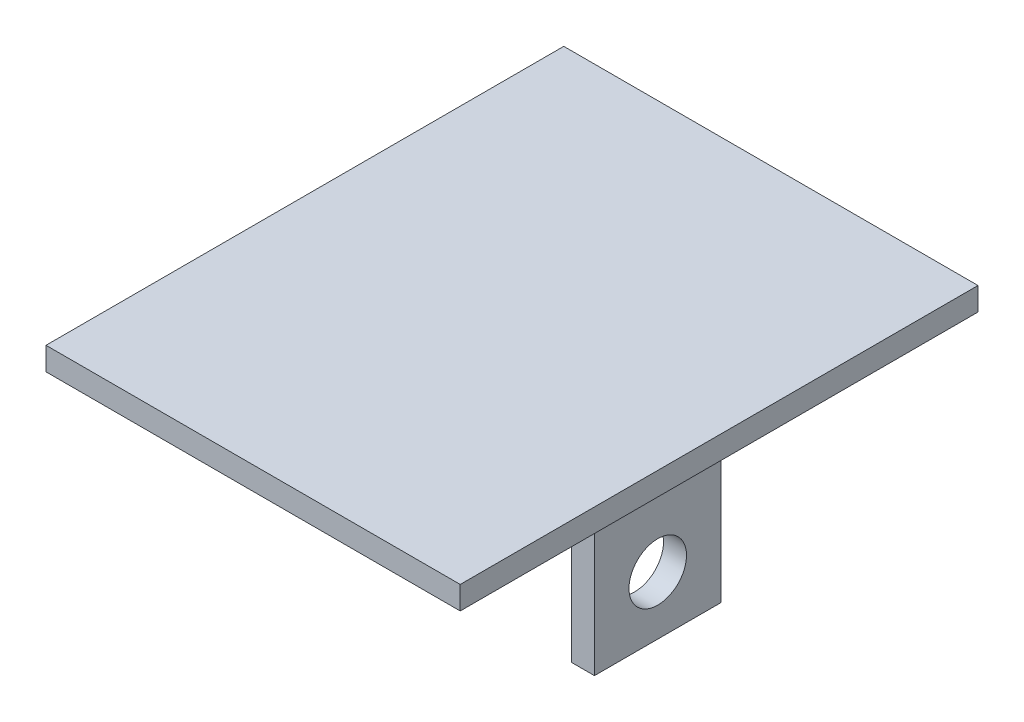
ISO-10303-21;
HEADER;
FILE_DESCRIPTION(('STEP AP214'),'2;1');
FILE_NAME('part.step','',(''),(''),'','','');
FILE_SCHEMA(('AUTOMOTIVE_DESIGN { 1 0 10303 214 1 1 1 1 }'));
ENDSEC;
DATA;
#1=APPLICATION_CONTEXT('core data for automotive mechanical design processes');
#2=APPLICATION_PROTOCOL_DEFINITION('international standard','automotive_design',2000,#1);
#3=PRODUCT_CONTEXT('',#1,'mechanical');
#4=PRODUCT('Part','Part','',(#3));
#5=PRODUCT_RELATED_PRODUCT_CATEGORY('part','',(#4));
#6=PRODUCT_DEFINITION_FORMATION('','',#4);
#7=PRODUCT_DEFINITION_CONTEXT('part definition',#1,'design');
#8=PRODUCT_DEFINITION('design','',#6,#7);
#9=PRODUCT_DEFINITION_SHAPE('','',#8);
#10=(LENGTH_UNIT() NAMED_UNIT(*) SI_UNIT(.MILLI.,.METRE.));
#11=(NAMED_UNIT(*) PLANE_ANGLE_UNIT() SI_UNIT($,.RADIAN.));
#12=(NAMED_UNIT(*) SI_UNIT($,.STERADIAN.) SOLID_ANGLE_UNIT());
#13=UNCERTAINTY_MEASURE_WITH_UNIT(LENGTH_MEASURE(1.E-05),#10,'distance_accuracy_value','');
#14=(GEOMETRIC_REPRESENTATION_CONTEXT(3) GLOBAL_UNCERTAINTY_ASSIGNED_CONTEXT((#13)) GLOBAL_UNIT_ASSIGNED_CONTEXT((#10,
#11,#12)) REPRESENTATION_CONTEXT('',''));
#15=CARTESIAN_POINT('',(0.,0.,0.));
#16=DIRECTION('',(0.,0.,1.));
#17=DIRECTION('',(1.,0.,0.));
#18=AXIS2_PLACEMENT_3D('',#15,#16,#17);
#19=CARTESIAN_POINT('',(0.,0.,0.));
#20=DIRECTION('',(0.,1.,0.));
#21=DIRECTION('',(0.,0.,1.));
#22=AXIS2_PLACEMENT_3D('',#19,#20,#21);
#23=PLANE('',#22);
#24=DIRECTION('',(1.,0.,0.));
#25=VECTOR('',#24,1.);
#26=CARTESIAN_POINT('',(0.,0.,-5.46614350086655));
#27=LINE('',#26,#25);
#28=CARTESIAN_POINT('',(10.7,0.,-5.46614350086655));
#29=VERTEX_POINT('',#28);
#30=CARTESIAN_POINT('',(12.7,0.,-5.46614350086655));
#31=VERTEX_POINT('',#30);
#32=EDGE_CURVE('E156',#29,#31,#27,.T.);
#33=ORIENTED_EDGE('',*,*,#32,.F.);
#34=DIRECTION('',(0.,0.,1.));
#35=VECTOR('',#34,1.);
#36=CARTESIAN_POINT('',(10.7,0.,0.));
#37=LINE('',#36,#35);
#38=CARTESIAN_POINT('',(10.7,0.,5.53385649913345));
#39=VERTEX_POINT('',#38);
#40=EDGE_CURVE('E129',#29,#39,#37,.T.);
#41=ORIENTED_EDGE('',*,*,#40,.T.);
#42=DIRECTION('',(1.,0.,0.));
#43=VECTOR('',#42,1.);
#44=CARTESIAN_POINT('',(0.,0.,5.53385649913345));
#45=LINE('',#44,#43);
#46=CARTESIAN_POINT('',(12.7,0.,5.53385649913345));
#47=VERTEX_POINT('',#46);
#48=EDGE_CURVE('E147',#39,#47,#45,.T.);
#49=ORIENTED_EDGE('',*,*,#48,.T.);
#50=DIRECTION('',(0.,0.,1.));
#51=VECTOR('',#50,1.);
#52=CARTESIAN_POINT('',(12.7,0.,0.));
#53=LINE('',#52,#51);
#54=EDGE_CURVE('E150',#31,#47,#53,.T.);
#55=ORIENTED_EDGE('',*,*,#54,.F.);
#56=EDGE_LOOP('',(#33,#41,#49,#55));
#57=FACE_BOUND('',#56,.T.);
#58=DIRECTION('',(0.,0.,-1.));
#59=VECTOR('',#58,1.);
#60=CARTESIAN_POINT('',(18.,0.,-22.5));
#61=LINE('',#60,#59);
#62=CARTESIAN_POINT('',(18.,0.,22.5));
#63=VERTEX_POINT('',#62);
#64=CARTESIAN_POINT('',(18.,0.,-22.5));
#65=VERTEX_POINT('',#64);
#66=EDGE_CURVE('E179',#63,#65,#61,.T.);
#67=ORIENTED_EDGE('',*,*,#66,.F.);
#68=DIRECTION('',(1.,0.,0.));
#69=VECTOR('',#68,1.);
#70=CARTESIAN_POINT('',(-18.,0.,22.5));
#71=LINE('',#70,#69);
#72=CARTESIAN_POINT('',(-18.,0.,22.5));
#73=VERTEX_POINT('',#72);
#74=EDGE_CURVE('E184',#73,#63,#71,.T.);
#75=ORIENTED_EDGE('',*,*,#74,.F.);
#76=DIRECTION('',(0.,0.,1.));
#77=VECTOR('',#76,1.);
#78=CARTESIAN_POINT('',(-18.,0.,-22.5));
#79=LINE('',#78,#77);
#80=CARTESIAN_POINT('',(-18.,0.,-22.5));
#81=VERTEX_POINT('',#80);
#82=EDGE_CURVE('E195',#81,#73,#79,.T.);
#83=ORIENTED_EDGE('',*,*,#82,.F.);
#84=DIRECTION('',(-1.,0.,0.));
#85=VECTOR('',#84,1.);
#86=CARTESIAN_POINT('',(-18.,0.,-22.5));
#87=LINE('',#86,#85);
#88=EDGE_CURVE('E193',#65,#81,#87,.T.);
#89=ORIENTED_EDGE('',*,*,#88,.F.);
#90=EDGE_LOOP('',(#67,#75,#83,#89));
#91=FACE_BOUND('',#90,.T.);
#92=DIRECTION('',(0.,0.,1.));
#93=VECTOR('',#92,1.);
#94=CARTESIAN_POINT('',(-15.,0.,0.));
#95=LINE('',#94,#93);
#96=CARTESIAN_POINT('',(-15.,0.,-5.5));
#97=VERTEX_POINT('',#96);
#98=CARTESIAN_POINT('',(-15.,0.,5.53385649913345));
#99=VERTEX_POINT('',#98);
#100=EDGE_CURVE('E11',#97,#99,#95,.T.);
#101=ORIENTED_EDGE('',*,*,#100,.F.);
#102=DIRECTION('',(-1.,0.,0.));
#103=VECTOR('',#102,1.);
#104=CARTESIAN_POINT('',(0.,0.,-5.5));
#105=LINE('',#104,#103);
#106=CARTESIAN_POINT('',(-17.,0.,-5.5));
#107=VERTEX_POINT('',#106);
#108=EDGE_CURVE('E209',#97,#107,#105,.T.);
#109=ORIENTED_EDGE('',*,*,#108,.T.);
#110=DIRECTION('',(0.,0.,1.));
#111=VECTOR('',#110,1.);
#112=CARTESIAN_POINT('',(-17.,0.,0.));
#113=LINE('',#112,#111);
#114=CARTESIAN_POINT('',(-17.,0.,5.53385649913345));
#115=VERTEX_POINT('',#114);
#116=EDGE_CURVE('E212',#107,#115,#113,.T.);
#117=ORIENTED_EDGE('',*,*,#116,.T.);
#118=DIRECTION('',(-1.,0.,0.));
#119=VECTOR('',#118,1.);
#120=CARTESIAN_POINT('',(0.,0.,5.53385649913345));
#121=LINE('',#120,#119);
#122=EDGE_CURVE('E41',#99,#115,#121,.T.);
#123=ORIENTED_EDGE('',*,*,#122,.F.);
#124=EDGE_LOOP('',(#101,#109,#117,#123));
#125=FACE_BOUND('',#124,.T.);
#126=ADVANCED_FACE('F33',(#57,#91,#125),#23,.F.);
#127=CARTESIAN_POINT('',(18.,2.,-22.5));
#128=DIRECTION('',(-1.,0.,0.));
#129=DIRECTION('',(0.,0.,1.));
#130=AXIS2_PLACEMENT_3D('',#127,#128,#129);
#131=PLANE('',#130);
#132=ORIENTED_EDGE('',*,*,#66,.T.);
#133=DIRECTION('',(0.,-1.,0.));
#134=VECTOR('',#133,1.);
#135=CARTESIAN_POINT('',(18.,2.,-22.5));
#136=LINE('',#135,#134);
#137=CARTESIAN_POINT('',(18.,2.,-22.5));
#138=VERTEX_POINT('',#137);
#139=EDGE_CURVE('E206',#138,#65,#136,.T.);
#140=ORIENTED_EDGE('',*,*,#139,.F.);
#141=DIRECTION('',(0.,0.,-1.));
#142=VECTOR('',#141,1.);
#143=CARTESIAN_POINT('',(18.,2.,-22.5));
#144=LINE('',#143,#142);
#145=CARTESIAN_POINT('',(18.,2.,22.5));
#146=VERTEX_POINT('',#145);
#147=EDGE_CURVE('E180',#146,#138,#144,.T.);
#148=ORIENTED_EDGE('',*,*,#147,.F.);
#149=DIRECTION('',(0.,-1.,0.));
#150=VECTOR('',#149,1.);
#151=CARTESIAN_POINT('',(18.,2.,22.5));
#152=LINE('',#151,#150);
#153=EDGE_CURVE('E190',#146,#63,#152,.T.);
#154=ORIENTED_EDGE('',*,*,#153,.T.);
#155=EDGE_LOOP('',(#132,#140,#148,#154));
#156=FACE_BOUND('',#155,.T.);
#157=ADVANCED_FACE('F35',(#156),#131,.F.);
#158=CARTESIAN_POINT('',(-18.,2.,-22.5));
#159=DIRECTION('',(0.,0.,1.));
#160=DIRECTION('',(1.,0.,0.));
#161=AXIS2_PLACEMENT_3D('',#158,#159,#160);
#162=PLANE('',#161);
#163=ORIENTED_EDGE('',*,*,#88,.T.);
#164=DIRECTION('',(0.,-1.,0.));
#165=VECTOR('',#164,1.);
#166=CARTESIAN_POINT('',(-18.,2.,-22.5));
#167=LINE('',#166,#165);
#168=CARTESIAN_POINT('',(-18.,2.,-22.5));
#169=VERTEX_POINT('',#168);
#170=EDGE_CURVE('E203',#169,#81,#167,.T.);
#171=ORIENTED_EDGE('',*,*,#170,.F.);
#172=DIRECTION('',(-1.,0.,0.));
#173=VECTOR('',#172,1.);
#174=CARTESIAN_POINT('',(-18.,2.,-22.5));
#175=LINE('',#174,#173);
#176=EDGE_CURVE('E183',#138,#169,#175,.T.);
#177=ORIENTED_EDGE('',*,*,#176,.F.);
#178=ORIENTED_EDGE('',*,*,#139,.T.);
#179=EDGE_LOOP('',(#163,#171,#177,#178));
#180=FACE_BOUND('',#179,.T.);
#181=ADVANCED_FACE('F247',(#180),#162,.F.);
#182=CARTESIAN_POINT('',(-18.,2.,-22.5));
#183=DIRECTION('',(1.,0.,0.));
#184=DIRECTION('',(0.,0.,-1.));
#185=AXIS2_PLACEMENT_3D('',#182,#183,#184);
#186=PLANE('',#185);
#187=ORIENTED_EDGE('',*,*,#82,.T.);
#188=DIRECTION('',(0.,-1.,0.));
#189=VECTOR('',#188,1.);
#190=CARTESIAN_POINT('',(-18.,2.,22.5));
#191=LINE('',#190,#189);
#192=CARTESIAN_POINT('',(-18.,2.,22.5));
#193=VERTEX_POINT('',#192);
#194=EDGE_CURVE('E200',#193,#73,#191,.T.);
#195=ORIENTED_EDGE('',*,*,#194,.F.);
#196=DIRECTION('',(0.,0.,1.));
#197=VECTOR('',#196,1.);
#198=CARTESIAN_POINT('',(-18.,2.,-22.5));
#199=LINE('',#198,#197);
#200=EDGE_CURVE('E186',#169,#193,#199,.T.);
#201=ORIENTED_EDGE('',*,*,#200,.F.);
#202=ORIENTED_EDGE('',*,*,#170,.T.);
#203=EDGE_LOOP('',(#187,#195,#201,#202));
#204=FACE_BOUND('',#203,.T.);
#205=ADVANCED_FACE('F257',(#204),#186,.F.);
#206=CARTESIAN_POINT('',(-18.,2.,22.5));
#207=DIRECTION('',(0.,0.,-1.));
#208=DIRECTION('',(-1.,0.,0.));
#209=AXIS2_PLACEMENT_3D('',#206,#207,#208);
#210=PLANE('',#209);
#211=ORIENTED_EDGE('',*,*,#74,.T.);
#212=ORIENTED_EDGE('',*,*,#153,.F.);
#213=DIRECTION('',(1.,0.,0.));
#214=VECTOR('',#213,1.);
#215=CARTESIAN_POINT('',(-18.,2.,22.5));
#216=LINE('',#215,#214);
#217=EDGE_CURVE('E188',#193,#146,#216,.T.);
#218=ORIENTED_EDGE('',*,*,#217,.F.);
#219=ORIENTED_EDGE('',*,*,#194,.T.);
#220=EDGE_LOOP('',(#211,#212,#218,#219));
#221=FACE_BOUND('',#220,.T.);
#222=ADVANCED_FACE('F254',(#221),#210,.F.);
#223=CARTESIAN_POINT('',(0.,2.,0.));
#224=DIRECTION('',(0.,1.,0.));
#225=DIRECTION('',(0.,0.,1.));
#226=AXIS2_PLACEMENT_3D('',#223,#224,#225);
#227=PLANE('',#226);
#228=ORIENTED_EDGE('',*,*,#147,.T.);
#229=ORIENTED_EDGE('',*,*,#176,.T.);
#230=ORIENTED_EDGE('',*,*,#200,.T.);
#231=ORIENTED_EDGE('',*,*,#217,.T.);
#232=EDGE_LOOP('',(#228,#229,#230,#231));
#233=FACE_BOUND('',#232,.T.);
#234=ADVANCED_FACE('F252',(#233),#227,.T.);
#235=CARTESIAN_POINT('',(-15.,-16.,-5.5));
#236=DIRECTION('',(-1.,0.,0.));
#237=DIRECTION('',(0.,0.,1.));
#238=AXIS2_PLACEMENT_3D('',#235,#236,#237);
#239=PLANE('',#238);
#240=CARTESIAN_POINT('',(-15.,-10.94,0.0338564991334495));
#241=DIRECTION('',(-1.,0.,0.));
#242=DIRECTION('',(0.,0.,1.));
#243=AXIS2_PLACEMENT_3D('',#240,#241,#242);
#244=CIRCLE('',#243,2.5);
#245=CARTESIAN_POINT('',(-15.,-10.94,2.53385649913345));
#246=VERTEX_POINT('',#245);
#247=EDGE_CURVE('E133',#246,#246,#244,.T.);
#248=ORIENTED_EDGE('',*,*,#247,.T.);
#249=EDGE_LOOP('',(#248));
#250=FACE_BOUND('',#249,.T.);
#251=DIRECTION('',(0.,1.,0.));
#252=VECTOR('',#251,1.);
#253=CARTESIAN_POINT('',(-15.,-16.,-5.5));
#254=LINE('',#253,#252);
#255=CARTESIAN_POINT('',(-15.,-16.,-5.5));
#256=VERTEX_POINT('',#255);
#257=EDGE_CURVE('E169',#256,#97,#254,.T.);
#258=ORIENTED_EDGE('',*,*,#257,.T.);
#259=ORIENTED_EDGE('',*,*,#100,.T.);
#260=DIRECTION('',(0.,1.,0.));
#261=VECTOR('',#260,1.);
#262=CARTESIAN_POINT('',(-15.,-16.,5.53385649913345));
#263=LINE('',#262,#261);
#264=CARTESIAN_POINT('',(-15.,-16.,5.53385649913345));
#265=VERTEX_POINT('',#264);
#266=EDGE_CURVE('E176',#265,#99,#263,.T.);
#267=ORIENTED_EDGE('',*,*,#266,.F.);
#268=DIRECTION('',(0.,0.,1.));
#269=VECTOR('',#268,1.);
#270=CARTESIAN_POINT('',(-15.,-16.,-5.5));
#271=LINE('',#270,#269);
#272=EDGE_CURVE('E159',#256,#265,#271,.T.);
#273=ORIENTED_EDGE('',*,*,#272,.F.);
#274=EDGE_LOOP('',(#258,#259,#267,#273));
#275=FACE_BOUND('',#274,.T.);
#276=ADVANCED_FACE('F227',(#250,#275),#239,.F.);
#277=CARTESIAN_POINT('',(-15.,-16.,5.53385649913345));
#278=DIRECTION('',(0.,0.,-1.));
#279=DIRECTION('',(-1.,0.,0.));
#280=AXIS2_PLACEMENT_3D('',#277,#278,#279);
#281=PLANE('',#280);
#282=ORIENTED_EDGE('',*,*,#266,.T.);
#283=ORIENTED_EDGE('',*,*,#122,.T.);
#284=DIRECTION('',(0.,1.,0.));
#285=VECTOR('',#284,1.);
#286=CARTESIAN_POINT('',(-17.,-16.,5.53385649913345));
#287=LINE('',#286,#285);
#288=CARTESIAN_POINT('',(-17.,-16.,5.53385649913345));
#289=VERTEX_POINT('',#288);
#290=EDGE_CURVE('E173',#289,#115,#287,.T.);
#291=ORIENTED_EDGE('',*,*,#290,.F.);
#292=DIRECTION('',(-1.,0.,0.));
#293=VECTOR('',#292,1.);
#294=CARTESIAN_POINT('',(-15.,-16.,5.53385649913345));
#295=LINE('',#294,#293);
#296=EDGE_CURVE('E162',#265,#289,#295,.T.);
#297=ORIENTED_EDGE('',*,*,#296,.F.);
#298=EDGE_LOOP('',(#282,#283,#291,#297));
#299=FACE_BOUND('',#298,.T.);
#300=ADVANCED_FACE('F217',(#299),#281,.F.);
#301=CARTESIAN_POINT('',(-17.,-16.,-5.5));
#302=DIRECTION('',(-1.,0.,0.));
#303=DIRECTION('',(0.,0.,1.));
#304=AXIS2_PLACEMENT_3D('',#301,#302,#303);
#305=PLANE('',#304);
#306=CARTESIAN_POINT('',(-17.,-10.94,0.0338564991334495));
#307=DIRECTION('',(-1.,0.,0.));
#308=DIRECTION('',(0.,0.,1.));
#309=AXIS2_PLACEMENT_3D('',#306,#307,#308);
#310=CIRCLE('',#309,2.5);
#311=CARTESIAN_POINT('',(-17.,-10.94,2.53385649913345));
#312=VERTEX_POINT('',#311);
#313=EDGE_CURVE('E293',#312,#312,#310,.T.);
#314=ORIENTED_EDGE('',*,*,#313,.F.);
#315=EDGE_LOOP('',(#314));
#316=FACE_BOUND('',#315,.T.);
#317=ORIENTED_EDGE('',*,*,#116,.F.);
#318=DIRECTION('',(0.,1.,0.));
#319=VECTOR('',#318,1.);
#320=CARTESIAN_POINT('',(-17.,-16.,-5.5));
#321=LINE('',#320,#319);
#322=CARTESIAN_POINT('',(-17.,-16.,-5.5));
#323=VERTEX_POINT('',#322);
#324=EDGE_CURVE('E56',#323,#107,#321,.T.);
#325=ORIENTED_EDGE('',*,*,#324,.F.);
#326=DIRECTION('',(0.,0.,1.));
#327=VECTOR('',#326,1.);
#328=CARTESIAN_POINT('',(-17.,-16.,-5.5));
#329=LINE('',#328,#327);
#330=EDGE_CURVE('E164',#323,#289,#329,.T.);
#331=ORIENTED_EDGE('',*,*,#330,.T.);
#332=ORIENTED_EDGE('',*,*,#290,.T.);
#333=EDGE_LOOP('',(#317,#325,#331,#332));
#334=FACE_BOUND('',#333,.T.);
#335=ADVANCED_FACE('F222',(#316,#334),#305,.T.);
#336=CARTESIAN_POINT('',(-15.,-16.,-5.5));
#337=DIRECTION('',(0.,0.,-1.));
#338=DIRECTION('',(-1.,0.,0.));
#339=AXIS2_PLACEMENT_3D('',#336,#337,#338);
#340=PLANE('',#339);
#341=ORIENTED_EDGE('',*,*,#108,.F.);
#342=ORIENTED_EDGE('',*,*,#257,.F.);
#343=DIRECTION('',(-1.,0.,0.));
#344=VECTOR('',#343,1.);
#345=CARTESIAN_POINT('',(-15.,-16.,-5.5));
#346=LINE('',#345,#344);
#347=EDGE_CURVE('E167',#256,#323,#346,.T.);
#348=ORIENTED_EDGE('',*,*,#347,.T.);
#349=ORIENTED_EDGE('',*,*,#324,.T.);
#350=EDGE_LOOP('',(#341,#342,#348,#349));
#351=FACE_BOUND('',#350,.T.);
#352=ADVANCED_FACE('F224',(#351),#340,.T.);
#353=CARTESIAN_POINT('',(0.,-16.,0.));
#354=DIRECTION('',(0.,-1.,0.));
#355=DIRECTION('',(0.,0.,-1.));
#356=AXIS2_PLACEMENT_3D('',#353,#354,#355);
#357=PLANE('',#356);
#358=ORIENTED_EDGE('',*,*,#272,.T.);
#359=ORIENTED_EDGE('',*,*,#296,.T.);
#360=ORIENTED_EDGE('',*,*,#330,.F.);
#361=ORIENTED_EDGE('',*,*,#347,.F.);
#362=EDGE_LOOP('',(#358,#359,#360,#361));
#363=FACE_BOUND('',#362,.T.);
#364=ADVANCED_FACE('F230',(#363),#357,.T.);
#365=CARTESIAN_POINT('',(10.7,-16.,-5.46614350086655));
#366=DIRECTION('',(-1.,0.,0.));
#367=DIRECTION('',(0.,0.,1.));
#368=AXIS2_PLACEMENT_3D('',#365,#366,#367);
#369=PLANE('',#368);
#370=CARTESIAN_POINT('',(10.7,-10.94,0.0338564991334495));
#371=DIRECTION('',(-1.,0.,0.));
#372=DIRECTION('',(0.,0.,1.));
#373=AXIS2_PLACEMENT_3D('',#370,#371,#372);
#374=CIRCLE('',#373,2.5);
#375=CARTESIAN_POINT('',(10.7,-10.94,2.53385649913345));
#376=VERTEX_POINT('',#375);
#377=EDGE_CURVE('E295',#376,#376,#374,.T.);
#378=ORIENTED_EDGE('',*,*,#377,.F.);
#379=EDGE_LOOP('',(#378));
#380=FACE_BOUND('',#379,.T.);
#381=ORIENTED_EDGE('',*,*,#40,.F.);
#382=DIRECTION('',(0.,1.,0.));
#383=VECTOR('',#382,1.);
#384=CARTESIAN_POINT('',(10.7,-16.,-5.46614350086655));
#385=LINE('',#384,#383);
#386=CARTESIAN_POINT('',(10.7,-16.,-5.46614350086655));
#387=VERTEX_POINT('',#386);
#388=EDGE_CURVE('E122',#387,#29,#385,.T.);
#389=ORIENTED_EDGE('',*,*,#388,.F.);
#390=DIRECTION('',(0.,0.,1.));
#391=VECTOR('',#390,1.);
#392=CARTESIAN_POINT('',(10.7,-16.,-5.46614350086655));
#393=LINE('',#392,#391);
#394=CARTESIAN_POINT('',(10.7,-16.,5.53385649913345));
#395=VERTEX_POINT('',#394);
#396=EDGE_CURVE('E127',#387,#395,#393,.T.);
#397=ORIENTED_EDGE('',*,*,#396,.T.);
#398=DIRECTION('',(0.,1.,0.));
#399=VECTOR('',#398,1.);
#400=CARTESIAN_POINT('',(10.7,-16.,5.53385649913345));
#401=LINE('',#400,#399);
#402=EDGE_CURVE('E142',#395,#39,#401,.T.);
#403=ORIENTED_EDGE('',*,*,#402,.T.);
#404=EDGE_LOOP('',(#381,#389,#397,#403));
#405=FACE_BOUND('',#404,.T.);
#406=ADVANCED_FACE('F124',(#380,#405),#369,.T.);
#407=CARTESIAN_POINT('',(10.7,-16.,-5.46614350086655));
#408=DIRECTION('',(0.,0.,1.));
#409=DIRECTION('',(1.,0.,0.));
#410=AXIS2_PLACEMENT_3D('',#407,#408,#409);
#411=PLANE('',#410);
#412=ORIENTED_EDGE('',*,*,#388,.T.);
#413=ORIENTED_EDGE('',*,*,#32,.T.);
#414=DIRECTION('',(0.,1.,0.));
#415=VECTOR('',#414,1.);
#416=CARTESIAN_POINT('',(12.7,-16.,-5.46614350086655));
#417=LINE('',#416,#415);
#418=CARTESIAN_POINT('',(12.7,-16.,-5.46614350086655));
#419=VERTEX_POINT('',#418);
#420=EDGE_CURVE('E132',#419,#31,#417,.T.);
#421=ORIENTED_EDGE('',*,*,#420,.F.);
#422=DIRECTION('',(1.,0.,0.));
#423=VECTOR('',#422,1.);
#424=CARTESIAN_POINT('',(10.7,-16.,-5.46614350086655));
#425=LINE('',#424,#423);
#426=EDGE_CURVE('E136',#387,#419,#425,.T.);
#427=ORIENTED_EDGE('',*,*,#426,.F.);
#428=EDGE_LOOP('',(#412,#413,#421,#427));
#429=FACE_BOUND('',#428,.T.);
#430=ADVANCED_FACE('F137',(#429),#411,.F.);
#431=CARTESIAN_POINT('',(12.7,-16.,-5.46614350086655));
#432=DIRECTION('',(-1.,0.,0.));
#433=DIRECTION('',(0.,0.,1.));
#434=AXIS2_PLACEMENT_3D('',#431,#432,#433);
#435=PLANE('',#434);
#436=CARTESIAN_POINT('',(12.7,-10.94,0.0338564991334495));
#437=DIRECTION('',(1.,0.,0.));
#438=DIRECTION('',(0.,0.,-1.));
#439=AXIS2_PLACEMENT_3D('',#436,#437,#438);
#440=CIRCLE('',#439,2.5);
#441=CARTESIAN_POINT('',(12.7,-10.94,-2.46614350086655));
#442=VERTEX_POINT('',#441);
#443=EDGE_CURVE('E299',#442,#442,#440,.T.);
#444=ORIENTED_EDGE('',*,*,#443,.F.);
#445=EDGE_LOOP('',(#444));
#446=FACE_BOUND('',#445,.T.);
#447=ORIENTED_EDGE('',*,*,#420,.T.);
#448=ORIENTED_EDGE('',*,*,#54,.T.);
#449=DIRECTION('',(0.,1.,0.));
#450=VECTOR('',#449,1.);
#451=CARTESIAN_POINT('',(12.7,-16.,5.53385649913345));
#452=LINE('',#451,#450);
#453=CARTESIAN_POINT('',(12.7,-16.,5.53385649913345));
#454=VERTEX_POINT('',#453);
#455=EDGE_CURVE('E48',#454,#47,#452,.T.);
#456=ORIENTED_EDGE('',*,*,#455,.F.);
#457=DIRECTION('',(0.,0.,1.));
#458=VECTOR('',#457,1.);
#459=CARTESIAN_POINT('',(12.7,-16.,-5.46614350086655));
#460=LINE('',#459,#458);
#461=EDGE_CURVE('E141',#419,#454,#460,.T.);
#462=ORIENTED_EDGE('',*,*,#461,.F.);
#463=EDGE_LOOP('',(#447,#448,#456,#462));
#464=FACE_BOUND('',#463,.T.);
#465=ADVANCED_FACE('F306',(#446,#464),#435,.F.);
#466=CARTESIAN_POINT('',(10.7,-16.,5.53385649913345));
#467=DIRECTION('',(0.,0.,1.));
#468=DIRECTION('',(1.,0.,0.));
#469=AXIS2_PLACEMENT_3D('',#466,#467,#468);
#470=PLANE('',#469);
#471=ORIENTED_EDGE('',*,*,#48,.F.);
#472=ORIENTED_EDGE('',*,*,#402,.F.);
#473=DIRECTION('',(1.,0.,0.));
#474=VECTOR('',#473,1.);
#475=CARTESIAN_POINT('',(10.7,-16.,5.53385649913345));
#476=LINE('',#475,#474);
#477=EDGE_CURVE('E146',#395,#454,#476,.T.);
#478=ORIENTED_EDGE('',*,*,#477,.T.);
#479=ORIENTED_EDGE('',*,*,#455,.T.);
#480=EDGE_LOOP('',(#471,#472,#478,#479));
#481=FACE_BOUND('',#480,.T.);
#482=ADVANCED_FACE('F308',(#481),#470,.T.);
#483=CARTESIAN_POINT('',(0.,-16.,0.));
#484=DIRECTION('',(0.,1.,0.));
#485=DIRECTION('',(0.,0.,1.));
#486=AXIS2_PLACEMENT_3D('',#483,#484,#485);
#487=PLANE('',#486);
#488=ORIENTED_EDGE('',*,*,#396,.F.);
#489=ORIENTED_EDGE('',*,*,#426,.T.);
#490=ORIENTED_EDGE('',*,*,#461,.T.);
#491=ORIENTED_EDGE('',*,*,#477,.F.);
#492=EDGE_LOOP('',(#488,#489,#490,#491));
#493=FACE_BOUND('',#492,.T.);
#494=ADVANCED_FACE('F145',(#493),#487,.F.);
#495=CARTESIAN_POINT('',(-20.3,-10.94,0.0338564991334495));
#496=DIRECTION('',(1.,0.,0.));
#497=DIRECTION('',(0.,0.,-1.));
#498=AXIS2_PLACEMENT_3D('',#495,#496,#497);
#499=CYLINDRICAL_SURFACE('',#498,2.5);
#500=ORIENTED_EDGE('',*,*,#377,.T.);
#501=EDGE_LOOP('',(#500));
#502=FACE_BOUND('',#501,.T.);
#503=ORIENTED_EDGE('',*,*,#443,.T.);
#504=EDGE_LOOP('',(#503));
#505=FACE_BOUND('',#504,.T.);
#506=ADVANCED_FACE('F315',(#502,#505),#499,.F.);
#507=ORIENTED_EDGE('',*,*,#313,.T.);
#508=EDGE_LOOP('',(#507));
#509=FACE_BOUND('',#508,.T.);
#510=ORIENTED_EDGE('',*,*,#247,.F.);
#511=EDGE_LOOP('',(#510));
#512=FACE_BOUND('',#511,.T.);
#513=ADVANCED_FACE('F341',(#509,#512),#499,.F.);
#514=CLOSED_SHELL('',(#126,#157,#181,#205,#222,#234,#276,#300,#335,#352,#364,#406,#430,#465,
#482,#494,#506,#513));
#515=MANIFOLD_SOLID_BREP('B2',#514);
#516=ADVANCED_BREP_SHAPE_REPRESENTATION('',(#18,#515),#14);
#517=SHAPE_DEFINITION_REPRESENTATION(#9,#516);
ENDSEC;
END-ISO-10303-21;
